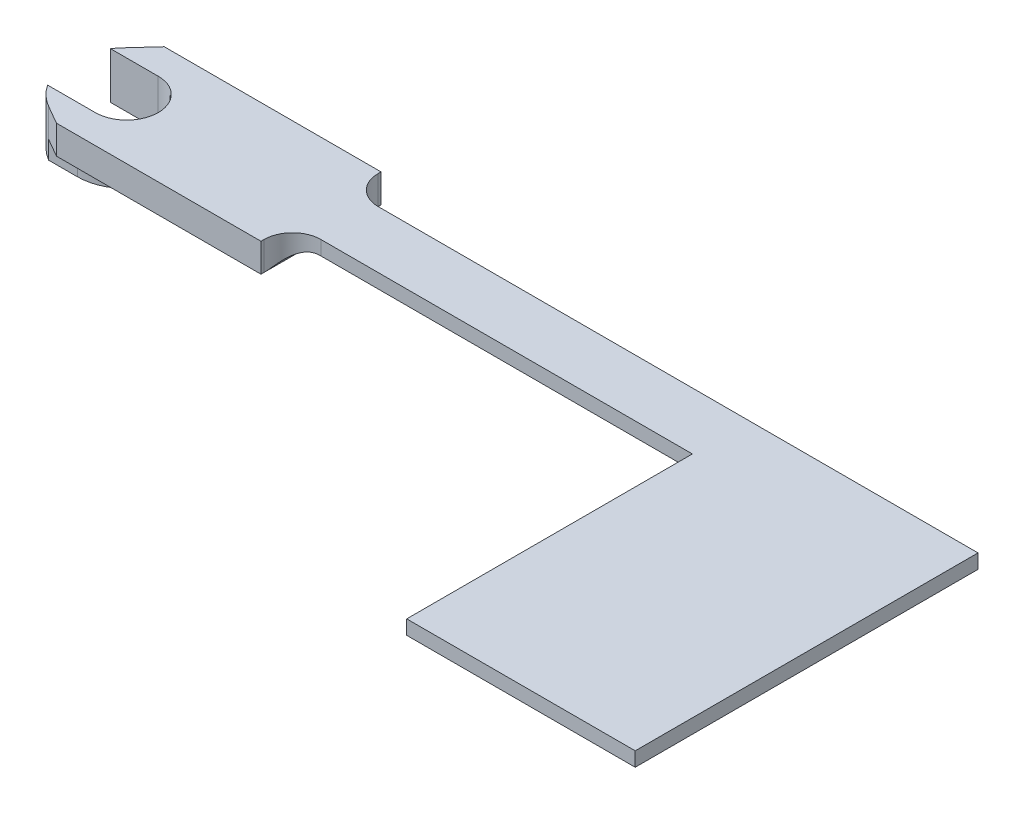
ISO-10303-21;
HEADER;
FILE_DESCRIPTION(('STEP AP214'),'2;1');
FILE_NAME('part.step','',(''),(''),'','','');
FILE_SCHEMA(('AUTOMOTIVE_DESIGN { 1 0 10303 214 1 1 1 1 }'));
ENDSEC;
DATA;
#1=APPLICATION_CONTEXT('core data for automotive mechanical design processes');
#2=APPLICATION_PROTOCOL_DEFINITION('international standard','automotive_design',2000,#1);
#3=PRODUCT_CONTEXT('',#1,'mechanical');
#4=PRODUCT('Part','Part','',(#3));
#5=PRODUCT_RELATED_PRODUCT_CATEGORY('part','',(#4));
#6=PRODUCT_DEFINITION_FORMATION('','',#4);
#7=PRODUCT_DEFINITION_CONTEXT('part definition',#1,'design');
#8=PRODUCT_DEFINITION('design','',#6,#7);
#9=PRODUCT_DEFINITION_SHAPE('','',#8);
#10=(LENGTH_UNIT() NAMED_UNIT(*) SI_UNIT(.MILLI.,.METRE.));
#11=(NAMED_UNIT(*) PLANE_ANGLE_UNIT() SI_UNIT($,.RADIAN.));
#12=(NAMED_UNIT(*) SI_UNIT($,.STERADIAN.) SOLID_ANGLE_UNIT());
#13=UNCERTAINTY_MEASURE_WITH_UNIT(LENGTH_MEASURE(1.E-05),#10,'distance_accuracy_value','');
#14=(GEOMETRIC_REPRESENTATION_CONTEXT(3) GLOBAL_UNCERTAINTY_ASSIGNED_CONTEXT((#13)) GLOBAL_UNIT_ASSIGNED_CONTEXT((#10,
#11,#12)) REPRESENTATION_CONTEXT('',''));
#15=CARTESIAN_POINT('',(0.,0.,0.));
#16=DIRECTION('',(0.,0.,1.));
#17=DIRECTION('',(1.,0.,0.));
#18=AXIS2_PLACEMENT_3D('',#15,#16,#17);
#19=CARTESIAN_POINT('',(21.5921904996352,0.,0.));
#20=DIRECTION('',(1.,0.,0.));
#21=DIRECTION('',(0.,0.,-1.));
#22=AXIS2_PLACEMENT_3D('',#19,#20,#21);
#23=PLANE('',#22);
#24=DIRECTION('',(0.,0.,1.));
#25=VECTOR('',#24,1.);
#26=CARTESIAN_POINT('',(21.5921904996352,3.96875,-6.6750057));
#27=LINE('',#26,#25);
#28=CARTESIAN_POINT('',(21.5921904996352,3.96875,-6.6750057));
#29=VERTEX_POINT('',#28);
#30=CARTESIAN_POINT('',(21.5921904996352,3.96875,-6.35));
#31=VERTEX_POINT('',#30);
#32=EDGE_CURVE('E343',#29,#31,#27,.T.);
#33=ORIENTED_EDGE('',*,*,#32,.T.);
#34=DIRECTION('',(0.,1.,0.));
#35=VECTOR('',#34,1.);
#36=CARTESIAN_POINT('',(21.5921904996352,0.,-6.35));
#37=LINE('',#36,#35);
#38=CARTESIAN_POINT('',(21.5921904996352,0.79375,-6.34999999999999));
#39=VERTEX_POINT('',#38);
#40=EDGE_CURVE('E558',#31,#39,#37,.F.);
#41=ORIENTED_EDGE('',*,*,#40,.T.);
#42=DIRECTION('',(0.,0.,-1.));
#43=VECTOR('',#42,1.);
#44=CARTESIAN_POINT('',(21.5921904996352,0.79375,6.6750057));
#45=LINE('',#44,#43);
#46=CARTESIAN_POINT('',(21.5921904996352,0.79375,-6.6750057));
#47=VERTEX_POINT('',#46);
#48=EDGE_CURVE('E332',#39,#47,#45,.T.);
#49=ORIENTED_EDGE('',*,*,#48,.T.);
#50=DIRECTION('',(0.,1.,0.));
#51=VECTOR('',#50,1.);
#52=CARTESIAN_POINT('',(21.5921904996352,0.79375,-6.6750057));
#53=LINE('',#52,#51);
#54=EDGE_CURVE('E337',#47,#29,#53,.T.);
#55=ORIENTED_EDGE('',*,*,#54,.T.);
#56=EDGE_LOOP('',(#33,#41,#49,#55));
#57=FACE_BOUND('',#56,.T.);
#58=ADVANCED_FACE('F67',(#57),#23,.T.);
#59=CARTESIAN_POINT('',(-3.175,4.7625,5.49926131403118));
#60=DIRECTION('',(0.5,0.,-0.866025403784439));
#61=DIRECTION('',(-0.866025403784438,0.,-0.5));
#62=AXIS2_PLACEMENT_3D('',#59,#60,#61);
#63=PLANE('',#62);
#64=DIRECTION('',(0.,1.,0.));
#65=VECTOR('',#64,1.);
#66=CARTESIAN_POINT('',(-1.13855098678815,-1.20625,6.6750057));
#67=LINE('',#66,#65);
#68=CARTESIAN_POINT('',(-1.13855098678815,0.79375,6.6750057));
#69=VERTEX_POINT('',#68);
#70=CARTESIAN_POINT('',(-1.13855098678815,3.96875,6.6750057));
#71=VERTEX_POINT('',#70);
#72=EDGE_CURVE('E384',#69,#71,#67,.T.);
#73=ORIENTED_EDGE('',*,*,#72,.T.);
#74=DIRECTION('',(0.866025403784439,0.,0.5));
#75=VECTOR('',#74,1.);
#76=CARTESIAN_POINT('',(-3.175,3.96875,5.49926131403118));
#77=LINE('',#76,#75);
#78=CARTESIAN_POINT('',(-3.175,3.96875,5.49926131403119));
#79=VERTEX_POINT('',#78);
#80=EDGE_CURVE('E468',#79,#71,#77,.T.);
#81=ORIENTED_EDGE('',*,*,#80,.F.);
#82=DIRECTION('',(0.,-1.,0.));
#83=VECTOR('',#82,1.);
#84=CARTESIAN_POINT('',(-3.175,4.7625,5.49926131403118));
#85=LINE('',#84,#83);
#86=CARTESIAN_POINT('',(-3.175,-1.20625,5.49926131403119));
#87=VERTEX_POINT('',#86);
#88=EDGE_CURVE('E534',#79,#87,#85,.T.);
#89=ORIENTED_EDGE('',*,*,#88,.T.);
#90=DIRECTION('',(-0.866025403784325,0.,-0.500000000000198));
#91=VECTOR('',#90,1.);
#92=CARTESIAN_POINT('',(-3.175,-1.20625,5.49926131403119));
#93=LINE('',#92,#91);
#94=CARTESIAN_POINT('',(-3.17371068568157,-1.20625,5.5000057));
#95=VERTEX_POINT('',#94);
#96=EDGE_CURVE('E434',#95,#87,#93,.T.);
#97=ORIENTED_EDGE('',*,*,#96,.F.);
#98=DIRECTION('',(0.,1.,0.));
#99=VECTOR('',#98,1.);
#100=CARTESIAN_POINT('',(-3.17371068568157,-1.20625,5.5000057));
#101=LINE('',#100,#99);
#102=CARTESIAN_POINT('',(-3.17371068568157,0.79375,5.5000057));
#103=VERTEX_POINT('',#102);
#104=EDGE_CURVE('E438',#95,#103,#101,.T.);
#105=ORIENTED_EDGE('',*,*,#104,.T.);
#106=DIRECTION('',(0.866025403784439,0.,0.5));
#107=VECTOR('',#106,1.);
#108=CARTESIAN_POINT('',(-3.175,0.79375,5.49926131403118));
#109=LINE('',#108,#107);
#110=EDGE_CURVE('E467',#103,#69,#109,.T.);
#111=ORIENTED_EDGE('',*,*,#110,.T.);
#112=EDGE_LOOP('',(#73,#81,#89,#97,#105,#111));
#113=FACE_BOUND('',#112,.T.);
#114=ADVANCED_FACE('F590',(#113),#63,.F.);
#115=CARTESIAN_POINT('',(28.3147962799527,0.79375,-49.0426657628404));
#116=DIRECTION('',(0.,-1.,0.));
#117=DIRECTION('',(1.,0.,0.));
#118=AXIS2_PLACEMENT_3D('',#115,#116,#117);
#119=PLANE('',#118);
#120=DIRECTION('',(-1.,0.,0.));
#121=VECTOR('',#120,1.);
#122=CARTESIAN_POINT('',(28.3147962799527,0.79375,-6.6750057));
#123=LINE('',#122,#121);
#124=CARTESIAN_POINT('',(-2.50679919036869,0.79375,-6.6750057));
#125=VERTEX_POINT('',#124);
#126=EDGE_CURVE('E397',#47,#125,#123,.T.);
#127=ORIENTED_EDGE('',*,*,#126,.F.);
#128=ORIENTED_EDGE('',*,*,#48,.F.);
#129=CARTESIAN_POINT('',(21.5921904996352,0.79375,6.35));
#130=VERTEX_POINT('',#129);
#131=EDGE_CURVE('E338',#130,#39,#45,.T.);
#132=ORIENTED_EDGE('',*,*,#131,.F.);
#133=CARTESIAN_POINT('',(21.5921904996352,0.79375,6.6750057));
#134=VERTEX_POINT('',#133);
#135=EDGE_CURVE('E333',#134,#130,#45,.T.);
#136=ORIENTED_EDGE('',*,*,#135,.F.);
#137=DIRECTION('',(-1.,0.,0.));
#138=VECTOR('',#137,1.);
#139=CARTESIAN_POINT('',(28.3147962799527,0.79375,6.6750057));
#140=LINE('',#139,#138);
#141=EDGE_CURVE('E387',#134,#69,#140,.T.);
#142=ORIENTED_EDGE('',*,*,#141,.T.);
#143=ORIENTED_EDGE('',*,*,#110,.F.);
#144=DIRECTION('',(-1.,0.,0.));
#145=VECTOR('',#144,1.);
#146=CARTESIAN_POINT('',(-3.17371068568157,0.79375,5.5000057));
#147=LINE('',#146,#145);
#148=CARTESIAN_POINT('',(0.,0.79375,5.5000057));
#149=VERTEX_POINT('',#148);
#150=EDGE_CURVE('E406',#149,#103,#147,.T.);
#151=ORIENTED_EDGE('',*,*,#150,.F.);
#152=CARTESIAN_POINT('',(0.,0.79375,0.));
#153=DIRECTION('',(0.,-1.,0.));
#154=DIRECTION('',(1.,0.,0.));
#155=AXIS2_PLACEMENT_3D('',#152,#153,#154);
#156=CIRCLE('',#155,5.5000057);
#157=CARTESIAN_POINT('',(0.,0.79375,-5.5000057));
#158=VERTEX_POINT('',#157);
#159=EDGE_CURVE('E442',#158,#149,#156,.T.);
#160=ORIENTED_EDGE('',*,*,#159,.F.);
#161=DIRECTION('',(1.,0.,0.));
#162=VECTOR('',#161,1.);
#163=CARTESIAN_POINT('',(-3.57830534978026,0.79375,-5.50000570000001));
#164=LINE('',#163,#162);
#165=CARTESIAN_POINT('',(-3.57830534978026,0.79375,-5.50000570000001));
#166=VERTEX_POINT('',#165);
#167=EDGE_CURVE('E400',#166,#158,#164,.T.);
#168=ORIENTED_EDGE('',*,*,#167,.F.);
#169=DIRECTION('',(-0.673816568047337,0.,0.738898661945539));
#170=VECTOR('',#169,1.);
#171=CARTESIAN_POINT('',(-4.69200650335417,0.79375,-4.27873520710059));
#172=LINE('',#171,#170);
#173=EDGE_CURVE('E472',#125,#166,#172,.T.);
#174=ORIENTED_EDGE('',*,*,#173,.F.);
#175=EDGE_LOOP('',(#127,#128,#132,#136,#142,#143,#151,#160,#168,#174));
#176=FACE_BOUND('',#175,.T.);
#177=ADVANCED_FACE('F599',(#176),#119,.T.);
#178=CARTESIAN_POINT('',(28.3147962799527,3.96875,-49.0426657628404));
#179=DIRECTION('',(0.,-1.,0.));
#180=DIRECTION('',(0.,0.,-1.));
#181=AXIS2_PLACEMENT_3D('',#178,#179,#180);
#182=PLANE('',#181);
#183=DIRECTION('',(1.,0.,0.));
#184=VECTOR('',#183,1.);
#185=CARTESIAN_POINT('',(0.,3.96875,6.6750057));
#186=LINE('',#185,#184);
#187=CARTESIAN_POINT('',(21.5921904996352,3.96875,6.6750057));
#188=VERTEX_POINT('',#187);
#189=EDGE_CURVE('E376',#71,#188,#186,.T.);
#190=ORIENTED_EDGE('',*,*,#189,.T.);
#191=CARTESIAN_POINT('',(21.5921904996352,3.96875,6.35));
#192=VERTEX_POINT('',#191);
#193=EDGE_CURVE('E342',#192,#188,#27,.T.);
#194=ORIENTED_EDGE('',*,*,#193,.F.);
#195=CARTESIAN_POINT('',(24.7671904996352,3.96875,6.35));
#196=DIRECTION('',(0.,-1.,0.));
#197=DIRECTION('',(0.,0.,-1.));
#198=AXIS2_PLACEMENT_3D('',#195,#196,#197);
#199=CIRCLE('',#198,3.175);
#200=CARTESIAN_POINT('',(24.7671904996352,3.96875,3.175));
#201=VERTEX_POINT('',#200);
#202=EDGE_CURVE('E83',#192,#201,#199,.T.);
#203=ORIENTED_EDGE('',*,*,#202,.T.);
#204=DIRECTION('',(1.,0.,0.));
#205=VECTOR('',#204,1.);
#206=CARTESIAN_POINT('',(0.,3.96875,3.175));
#207=LINE('',#206,#205);
#208=CARTESIAN_POINT('',(66.0421904996352,3.96875,3.175));
#209=VERTEX_POINT('',#208);
#210=EDGE_CURVE('E314',#201,#209,#207,.T.);
#211=ORIENTED_EDGE('',*,*,#210,.T.);
#212=DIRECTION('',(0.,0.,1.));
#213=VECTOR('',#212,1.);
#214=CARTESIAN_POINT('',(66.0421904996352,3.96875,0.));
#215=LINE('',#214,#213);
#216=CARTESIAN_POINT('',(66.0421904996352,3.96875,34.925));
#217=VERTEX_POINT('',#216);
#218=EDGE_CURVE('E298',#209,#217,#215,.T.);
#219=ORIENTED_EDGE('',*,*,#218,.T.);
#220=DIRECTION('',(-1.,0.,0.));
#221=VECTOR('',#220,1.);
#222=CARTESIAN_POINT('',(0.,3.96875,34.925));
#223=LINE('',#222,#221);
#224=CARTESIAN_POINT('',(91.4421904996352,3.96875,34.925));
#225=VERTEX_POINT('',#224);
#226=EDGE_CURVE('E294',#225,#217,#223,.T.);
#227=ORIENTED_EDGE('',*,*,#226,.F.);
#228=DIRECTION('',(0.,0.,1.));
#229=VECTOR('',#228,1.);
#230=CARTESIAN_POINT('',(91.4421904996352,3.96875,0.));
#231=LINE('',#230,#229);
#232=CARTESIAN_POINT('',(91.4421904996352,3.96875,-3.175));
#233=VERTEX_POINT('',#232);
#234=EDGE_CURVE('E309',#233,#225,#231,.T.);
#235=ORIENTED_EDGE('',*,*,#234,.F.);
#236=DIRECTION('',(1.,0.,0.));
#237=VECTOR('',#236,1.);
#238=CARTESIAN_POINT('',(0.,3.96875,-3.175));
#239=LINE('',#238,#237);
#240=CARTESIAN_POINT('',(24.7671904996352,3.96875,-3.175));
#241=VERTEX_POINT('',#240);
#242=EDGE_CURVE('E282',#241,#233,#239,.T.);
#243=ORIENTED_EDGE('',*,*,#242,.F.);
#244=CARTESIAN_POINT('',(24.7671904996352,3.96875,-6.35));
#245=DIRECTION('',(0.,-1.,0.));
#246=DIRECTION('',(0.,0.,-1.));
#247=AXIS2_PLACEMENT_3D('',#244,#245,#246);
#248=CIRCLE('',#247,3.175);
#249=EDGE_CURVE('E566',#241,#31,#248,.T.);
#250=ORIENTED_EDGE('',*,*,#249,.T.);
#251=ORIENTED_EDGE('',*,*,#32,.F.);
#252=DIRECTION('',(1.,0.,0.));
#253=VECTOR('',#252,1.);
#254=CARTESIAN_POINT('',(0.,3.96875,-6.6750057));
#255=LINE('',#254,#253);
#256=CARTESIAN_POINT('',(-2.50679919036869,3.96875,-6.6750057));
#257=VERTEX_POINT('',#256);
#258=EDGE_CURVE('E380',#257,#29,#255,.T.);
#259=ORIENTED_EDGE('',*,*,#258,.F.);
#260=DIRECTION('',(-0.673816568047337,0.,0.738898661945539));
#261=VECTOR('',#260,1.);
#262=CARTESIAN_POINT('',(-4.69200650335417,3.96875,-4.27873520710059));
#263=LINE('',#262,#261);
#264=CARTESIAN_POINT('',(-4.69200650335417,3.96875,-4.27873520710059));
#265=VERTEX_POINT('',#264);
#266=EDGE_CURVE('E537',#257,#265,#263,.T.);
#267=ORIENTED_EDGE('',*,*,#266,.T.);
#268=CARTESIAN_POINT('',(0.,3.96875,0.));
#269=DIRECTION('',(0.,-1.,0.));
#270=DIRECTION('',(0.,0.,-1.));
#271=AXIS2_PLACEMENT_3D('',#268,#269,#270);
#272=CIRCLE('',#271,6.35);
#273=CARTESIAN_POINT('',(-5.29834503406182,3.96875,-3.5000057));
#274=VERTEX_POINT('',#273);
#275=EDGE_CURVE('E478',#274,#265,#272,.T.);
#276=ORIENTED_EDGE('',*,*,#275,.F.);
#277=DIRECTION('',(1.,0.,0.));
#278=VECTOR('',#277,1.);
#279=CARTESIAN_POINT('',(28.3147962799527,3.96875,-3.5000057));
#280=LINE('',#279,#278);
#281=CARTESIAN_POINT('',(0.,3.96875,-3.5000057));
#282=VERTEX_POINT('',#281);
#283=EDGE_CURVE('E540',#274,#282,#280,.T.);
#284=ORIENTED_EDGE('',*,*,#283,.T.);
#285=CARTESIAN_POINT('',(0.,3.96875,0.));
#286=DIRECTION('',(0.,-1.,0.));
#287=DIRECTION('',(0.,0.,-1.));
#288=AXIS2_PLACEMENT_3D('',#285,#286,#287);
#289=CIRCLE('',#288,3.5000057);
#290=CARTESIAN_POINT('',(0.,3.96875,3.5000057));
#291=VERTEX_POINT('',#290);
#292=EDGE_CURVE('E544',#282,#291,#289,.T.);
#293=ORIENTED_EDGE('',*,*,#292,.T.);
#294=DIRECTION('',(-1.,0.,0.));
#295=VECTOR('',#294,1.);
#296=CARTESIAN_POINT('',(28.3147962799528,3.96875,3.5000057));
#297=LINE('',#296,#295);
#298=CARTESIAN_POINT('',(-5.29834503406182,3.96875,3.5000057));
#299=VERTEX_POINT('',#298);
#300=EDGE_CURVE('E548',#291,#299,#297,.T.);
#301=ORIENTED_EDGE('',*,*,#300,.T.);
#302=EDGE_CURVE('E479',#79,#299,#272,.T.);
#303=ORIENTED_EDGE('',*,*,#302,.F.);
#304=ORIENTED_EDGE('',*,*,#80,.T.);
#305=EDGE_LOOP('',(#190,#194,#203,#211,#219,#227,#235,#243,#250,#251,#259,#267,#276,#284,#293,
#301,#303,#304));
#306=FACE_BOUND('',#305,.T.);
#307=ADVANCED_FACE('F631',(#306),#182,.F.);
#308=CARTESIAN_POINT('',(0.,4.7625,0.));
#309=DIRECTION('',(0.,-1.,0.));
#310=DIRECTION('',(0.,0.,-1.));
#311=AXIS2_PLACEMENT_3D('',#308,#309,#310);
#312=CYLINDRICAL_SURFACE('',#311,6.35);
#313=ORIENTED_EDGE('',*,*,#302,.T.);
#314=DIRECTION('',(0.,-1.,0.));
#315=VECTOR('',#314,1.);
#316=CARTESIAN_POINT('',(-5.29834503406182,16.8464882443737,3.5000057));
#317=LINE('',#316,#315);
#318=CARTESIAN_POINT('',(-5.29834503406182,-1.20625,3.5000057));
#319=VERTEX_POINT('',#318);
#320=EDGE_CURVE('E519',#299,#319,#317,.T.);
#321=ORIENTED_EDGE('',*,*,#320,.T.);
#322=CARTESIAN_POINT('',(0.,-1.20625,0.));
#323=DIRECTION('',(0.,-1.,0.));
#324=DIRECTION('',(1.,0.,0.));
#325=AXIS2_PLACEMENT_3D('',#322,#323,#324);
#326=CIRCLE('',#325,6.35);
#327=EDGE_CURVE('E401',#87,#319,#326,.T.);
#328=ORIENTED_EDGE('',*,*,#327,.F.);
#329=ORIENTED_EDGE('',*,*,#88,.F.);
#330=EDGE_LOOP('',(#313,#321,#328,#329));
#331=FACE_BOUND('',#330,.T.);
#332=ADVANCED_FACE('F682',(#331),#312,.T.);
#333=CARTESIAN_POINT('',(0.,16.8464882443737,0.));
#334=DIRECTION('',(0.,-1.,0.));
#335=DIRECTION('',(0.,0.,-1.));
#336=AXIS2_PLACEMENT_3D('',#333,#334,#335);
#337=CYLINDRICAL_SURFACE('',#336,3.5000057);
#338=DIRECTION('',(0.,-1.,0.));
#339=VECTOR('',#338,1.);
#340=CARTESIAN_POINT('',(0.,16.8464882443737,3.5000057));
#341=LINE('',#340,#339);
#342=CARTESIAN_POINT('',(0.,-1.20625,3.5000057));
#343=VERTEX_POINT('',#342);
#344=EDGE_CURVE('E523',#291,#343,#341,.T.);
#345=ORIENTED_EDGE('',*,*,#344,.F.);
#346=ORIENTED_EDGE('',*,*,#292,.F.);
#347=DIRECTION('',(0.,-1.,0.));
#348=VECTOR('',#347,1.);
#349=CARTESIAN_POINT('',(0.,16.8464882443737,-3.5000057));
#350=LINE('',#349,#348);
#351=CARTESIAN_POINT('',(0.,-1.20625,-3.5000057));
#352=VERTEX_POINT('',#351);
#353=EDGE_CURVE('E520',#282,#352,#350,.T.);
#354=ORIENTED_EDGE('',*,*,#353,.T.);
#355=CARTESIAN_POINT('',(0.,-1.20625,0.));
#356=DIRECTION('',(0.,1.,0.));
#357=DIRECTION('',(1.,0.,0.));
#358=AXIS2_PLACEMENT_3D('',#355,#356,#357);
#359=CIRCLE('',#358,3.5000057);
#360=EDGE_CURVE('E410',#343,#352,#359,.T.);
#361=ORIENTED_EDGE('',*,*,#360,.F.);
#362=EDGE_LOOP('',(#345,#346,#354,#361));
#363=FACE_BOUND('',#362,.T.);
#364=CARTESIAN_POINT('',(0.,3.37125,0.));
#365=DIRECTION('',(0.,-1.,0.));
#366=DIRECTION('',(0.,0.,-1.));
#367=AXIS2_PLACEMENT_3D('',#364,#365,#366);
#368=CIRCLE('',#367,3.5000057);
#369=CARTESIAN_POINT('',(1.80278670397595,3.37125,-3.));
#370=VERTEX_POINT('',#369);
#371=CARTESIAN_POINT('',(1.80278670397595,3.37125,3.));
#372=VERTEX_POINT('',#371);
#373=EDGE_CURVE('E464',#370,#372,#368,.T.);
#374=ORIENTED_EDGE('',*,*,#373,.T.);
#375=DIRECTION('',(0.,1.,0.));
#376=VECTOR('',#375,1.);
#377=CARTESIAN_POINT('',(1.80278670397595,-17.0880074906351,3.));
#378=LINE('',#377,#376);
#379=CARTESIAN_POINT('',(1.80278670397595,1.39125,3.));
#380=VERTEX_POINT('',#379);
#381=EDGE_CURVE('E505',#380,#372,#378,.T.);
#382=ORIENTED_EDGE('',*,*,#381,.F.);
#383=CARTESIAN_POINT('',(0.,1.39125,0.));
#384=DIRECTION('',(0.,1.,0.));
#385=DIRECTION('',(0.,0.,1.));
#386=AXIS2_PLACEMENT_3D('',#383,#384,#385);
#387=CIRCLE('',#386,3.5000057);
#388=CARTESIAN_POINT('',(1.80278670397595,1.39125,-3.));
#389=VERTEX_POINT('',#388);
#390=EDGE_CURVE('E489',#389,#380,#387,.F.);
#391=ORIENTED_EDGE('',*,*,#390,.F.);
#392=DIRECTION('',(0.,1.,0.));
#393=VECTOR('',#392,1.);
#394=CARTESIAN_POINT('',(1.80278670397595,-17.0880074906351,-3.));
#395=LINE('',#394,#393);
#396=EDGE_CURVE('E501',#389,#370,#395,.T.);
#397=ORIENTED_EDGE('',*,*,#396,.T.);
#398=EDGE_LOOP('',(#374,#382,#391,#397));
#399=FACE_BOUND('',#398,.T.);
#400=ADVANCED_FACE('F675',(#363,#399),#337,.F.);
#401=DIRECTION('',(0.,-1.,0.));
#402=VECTOR('',#401,1.);
#403=CARTESIAN_POINT('',(-5.29834503406182,16.8464882443737,-3.5000057));
#404=LINE('',#403,#402);
#405=CARTESIAN_POINT('',(-5.29834503406182,-1.20625,-3.5000057));
#406=VERTEX_POINT('',#405);
#407=EDGE_CURVE('E524',#274,#406,#404,.T.);
#408=ORIENTED_EDGE('',*,*,#407,.F.);
#409=ORIENTED_EDGE('',*,*,#275,.T.);
#410=DIRECTION('',(0.,-1.,0.));
#411=VECTOR('',#410,1.);
#412=CARTESIAN_POINT('',(-4.69200650335417,4.7625,-4.27873520710059));
#413=LINE('',#412,#411);
#414=CARTESIAN_POINT('',(-4.69200650335417,-1.20625,-4.27873520710059));
#415=VERTEX_POINT('',#414);
#416=EDGE_CURVE('E531',#265,#415,#413,.T.);
#417=ORIENTED_EDGE('',*,*,#416,.T.);
#418=CARTESIAN_POINT('',(0.,-1.20625,0.));
#419=DIRECTION('',(0.,-1.,0.));
#420=DIRECTION('',(1.,0.,0.));
#421=AXIS2_PLACEMENT_3D('',#418,#419,#420);
#422=CIRCLE('',#421,6.35);
#423=EDGE_CURVE('E418',#406,#415,#422,.T.);
#424=ORIENTED_EDGE('',*,*,#423,.F.);
#425=EDGE_LOOP('',(#408,#409,#417,#424));
#426=FACE_BOUND('',#425,.T.);
#427=ADVANCED_FACE('F663',(#426),#312,.T.);
#428=CARTESIAN_POINT('',(-4.69200650335417,4.7625,-4.27873520710059));
#429=DIRECTION('',(-0.738898661945539,0.,-0.673816568047337));
#430=DIRECTION('',(-0.673816568047337,0.,0.738898661945539));
#431=AXIS2_PLACEMENT_3D('',#428,#429,#430);
#432=PLANE('',#431);
#433=DIRECTION('',(0.,1.,0.));
#434=VECTOR('',#433,1.);
#435=CARTESIAN_POINT('',(-2.50679919036869,-1.20625,-6.6750057));
#436=LINE('',#435,#434);
#437=EDGE_CURVE('E383',#125,#257,#436,.T.);
#438=ORIENTED_EDGE('',*,*,#437,.F.);
#439=ORIENTED_EDGE('',*,*,#173,.T.);
#440=DIRECTION('',(0.,1.,0.));
#441=VECTOR('',#440,1.);
#442=CARTESIAN_POINT('',(-3.57830534978026,-1.20625,-5.50000570000001));
#443=LINE('',#442,#441);
#444=CARTESIAN_POINT('',(-3.57830534978026,-1.20625,-5.50000570000001));
#445=VERTEX_POINT('',#444);
#446=EDGE_CURVE('E460',#445,#166,#443,.T.);
#447=ORIENTED_EDGE('',*,*,#446,.F.);
#448=DIRECTION('',(0.67381656804734,0.,-0.738898661945537));
#449=VECTOR('',#448,1.);
#450=CARTESIAN_POINT('',(-3.57830534978026,-1.20625,-5.50000570000001));
#451=LINE('',#450,#449);
#452=EDGE_CURVE('E422',#415,#445,#451,.T.);
#453=ORIENTED_EDGE('',*,*,#452,.F.);
#454=ORIENTED_EDGE('',*,*,#416,.F.);
#455=ORIENTED_EDGE('',*,*,#266,.F.);
#456=EDGE_LOOP('',(#438,#439,#447,#453,#454,#455));
#457=FACE_BOUND('',#456,.T.);
#458=ADVANCED_FACE('F658',(#457),#432,.T.);
#459=CARTESIAN_POINT('',(0.,16.8464882443737,3.5000057));
#460=DIRECTION('',(0.,0.,1.));
#461=DIRECTION('',(1.,0.,0.));
#462=AXIS2_PLACEMENT_3D('',#459,#460,#461);
#463=PLANE('',#462);
#464=ORIENTED_EDGE('',*,*,#344,.T.);
#465=DIRECTION('',(1.,0.,0.));
#466=VECTOR('',#465,1.);
#467=CARTESIAN_POINT('',(-5.29834503406182,-1.20625,3.5000057));
#468=LINE('',#467,#466);
#469=EDGE_CURVE('E405',#319,#343,#468,.T.);
#470=ORIENTED_EDGE('',*,*,#469,.F.);
#471=ORIENTED_EDGE('',*,*,#320,.F.);
#472=ORIENTED_EDGE('',*,*,#300,.F.);
#473=EDGE_LOOP('',(#464,#470,#471,#472));
#474=FACE_BOUND('',#473,.T.);
#475=ADVANCED_FACE('F679',(#474),#463,.F.);
#476=CARTESIAN_POINT('',(0.,16.8464882443737,-3.5000057));
#477=DIRECTION('',(0.,0.,1.));
#478=DIRECTION('',(1.,0.,0.));
#479=AXIS2_PLACEMENT_3D('',#476,#477,#478);
#480=PLANE('',#479);
#481=ORIENTED_EDGE('',*,*,#407,.T.);
#482=DIRECTION('',(-1.,0.,0.));
#483=VECTOR('',#482,1.);
#484=CARTESIAN_POINT('',(-5.29834503406182,-1.20625,-3.5000057));
#485=LINE('',#484,#483);
#486=EDGE_CURVE('E414',#352,#406,#485,.T.);
#487=ORIENTED_EDGE('',*,*,#486,.F.);
#488=ORIENTED_EDGE('',*,*,#353,.F.);
#489=ORIENTED_EDGE('',*,*,#283,.F.);
#490=EDGE_LOOP('',(#481,#487,#488,#489));
#491=FACE_BOUND('',#490,.T.);
#492=ADVANCED_FACE('F669',(#491),#480,.T.);
#493=CARTESIAN_POINT('',(0.,3.37125,0.));
#494=DIRECTION('',(0.,1.,0.));
#495=DIRECTION('',(0.,0.,1.));
#496=AXIS2_PLACEMENT_3D('',#493,#494,#495);
#497=PLANE('',#496);
#498=DIRECTION('',(-0.998052578482889,0.,0.0623782861551805));
#499=VECTOR('',#498,1.);
#500=CARTESIAN_POINT('',(17.802786703976,3.37125,2.));
#501=LINE('',#500,#499);
#502=CARTESIAN_POINT('',(17.5479858090224,3.37125,2.0159250559346));
#503=VERTEX_POINT('',#502);
#504=EDGE_CURVE('E497',#503,#372,#501,.T.);
#505=ORIENTED_EDGE('',*,*,#504,.T.);
#506=ORIENTED_EDGE('',*,*,#373,.F.);
#507=DIRECTION('',(0.998052578482889,0.,0.0623782861551805));
#508=VECTOR('',#507,1.);
#509=CARTESIAN_POINT('',(1.80278670397595,3.37125,-3.));
#510=LINE('',#509,#508);
#511=CARTESIAN_POINT('',(17.5479858090224,3.37125,-2.0159250559346));
#512=VERTEX_POINT('',#511);
#513=EDGE_CURVE('E483',#370,#512,#510,.T.);
#514=ORIENTED_EDGE('',*,*,#513,.T.);
#515=DIRECTION('',(1.,0.,0.));
#516=VECTOR('',#515,1.);
#517=CARTESIAN_POINT('',(-5.30034503406181,3.37125,-2.0159250559346));
#518=LINE('',#517,#516);
#519=CARTESIAN_POINT('',(18.4171904996352,3.37125,-2.0159250559346));
#520=VERTEX_POINT('',#519);
#521=EDGE_CURVE('E363',#512,#520,#518,.T.);
#522=ORIENTED_EDGE('',*,*,#521,.T.);
#523=DIRECTION('',(0.,0.,1.));
#524=VECTOR('',#523,1.);
#525=CARTESIAN_POINT('',(18.4171904996352,3.37125,2.0159250559346));
#526=LINE('',#525,#524);
#527=CARTESIAN_POINT('',(18.4171904996352,3.37125,2.0159250559346));
#528=VERTEX_POINT('',#527);
#529=EDGE_CURVE('E348',#520,#528,#526,.T.);
#530=ORIENTED_EDGE('',*,*,#529,.T.);
#531=DIRECTION('',(1.,0.,0.));
#532=VECTOR('',#531,1.);
#533=CARTESIAN_POINT('',(-5.30034503406181,3.37125,2.0159250559346));
#534=LINE('',#533,#532);
#535=EDGE_CURVE('E367',#503,#528,#534,.T.);
#536=ORIENTED_EDGE('',*,*,#535,.F.);
#537=EDGE_LOOP('',(#505,#506,#514,#522,#530,#536));
#538=FACE_BOUND('',#537,.T.);
#539=ADVANCED_FACE('F720',(#538),#497,.F.);
#540=CARTESIAN_POINT('',(17.802786703976,-17.0880074906351,2.));
#541=DIRECTION('',(-0.0623782861551805,0.,-0.998052578482889));
#542=DIRECTION('',(-0.998052578482889,0.,0.0623782861551805));
#543=AXIS2_PLACEMENT_3D('',#540,#541,#542);
#544=PLANE('',#543);
#545=DIRECTION('',(0.998052578482889,0.,-0.0623782861551805));
#546=VECTOR('',#545,1.);
#547=CARTESIAN_POINT('',(17.802786703976,1.39125,2.));
#548=LINE('',#547,#546);
#549=CARTESIAN_POINT('',(17.5479858090224,1.39125,2.0159250559346));
#550=VERTEX_POINT('',#549);
#551=EDGE_CURVE('E484',#380,#550,#548,.T.);
#552=ORIENTED_EDGE('',*,*,#551,.F.);
#553=ORIENTED_EDGE('',*,*,#381,.T.);
#554=ORIENTED_EDGE('',*,*,#504,.F.);
#555=DIRECTION('',(0.,-1.,0.));
#556=VECTOR('',#555,1.);
#557=CARTESIAN_POINT('',(17.5479858090224,4.7625,2.0159250559346));
#558=LINE('',#557,#556);
#559=EDGE_CURVE('E515',#550,#503,#558,.F.);
#560=ORIENTED_EDGE('',*,*,#559,.F.);
#561=EDGE_LOOP('',(#552,#553,#554,#560));
#562=FACE_BOUND('',#561,.T.);
#563=ADVANCED_FACE('F717',(#562),#544,.T.);
#564=CARTESIAN_POINT('',(1.80278670397595,-17.0880074906351,-3.));
#565=DIRECTION('',(-0.0623782861551805,0.,0.998052578482889));
#566=DIRECTION('',(0.998052578482889,0.,0.0623782861551805));
#567=AXIS2_PLACEMENT_3D('',#564,#565,#566);
#568=PLANE('',#567);
#569=ORIENTED_EDGE('',*,*,#513,.F.);
#570=ORIENTED_EDGE('',*,*,#396,.F.);
#571=DIRECTION('',(-0.998052578482889,0.,-0.0623782861551805));
#572=VECTOR('',#571,1.);
#573=CARTESIAN_POINT('',(1.80278670397595,1.39125,-3.));
#574=LINE('',#573,#572);
#575=CARTESIAN_POINT('',(17.5479858090223,1.39125,-2.0159250559346));
#576=VERTEX_POINT('',#575);
#577=EDGE_CURVE('E488',#576,#389,#574,.T.);
#578=ORIENTED_EDGE('',*,*,#577,.F.);
#579=DIRECTION('',(0.,-1.,0.));
#580=VECTOR('',#579,1.);
#581=CARTESIAN_POINT('',(17.5479858090224,4.7625,-2.0159250559346));
#582=LINE('',#581,#580);
#583=EDGE_CURVE('E493',#512,#576,#582,.T.);
#584=ORIENTED_EDGE('',*,*,#583,.F.);
#585=EDGE_LOOP('',(#569,#570,#578,#584));
#586=FACE_BOUND('',#585,.T.);
#587=ADVANCED_FACE('F709',(#586),#568,.T.);
#588=CARTESIAN_POINT('',(0.,1.39125,0.));
#589=DIRECTION('',(0.,1.,0.));
#590=DIRECTION('',(0.,0.,1.));
#591=AXIS2_PLACEMENT_3D('',#588,#589,#590);
#592=PLANE('',#591);
#593=ORIENTED_EDGE('',*,*,#577,.T.);
#594=ORIENTED_EDGE('',*,*,#390,.T.);
#595=ORIENTED_EDGE('',*,*,#551,.T.);
#596=DIRECTION('',(1.,0.,0.));
#597=VECTOR('',#596,1.);
#598=CARTESIAN_POINT('',(-5.30034503406181,1.39125,2.0159250559346));
#599=LINE('',#598,#597);
#600=CARTESIAN_POINT('',(18.4171904996352,1.39125,2.0159250559346));
#601=VERTEX_POINT('',#600);
#602=EDGE_CURVE('E371',#550,#601,#599,.T.);
#603=ORIENTED_EDGE('',*,*,#602,.T.);
#604=DIRECTION('',(0.,0.,-1.));
#605=VECTOR('',#604,1.);
#606=CARTESIAN_POINT('',(18.4171904996352,1.39125,-2.0159250559346));
#607=LINE('',#606,#605);
#608=CARTESIAN_POINT('',(18.4171904996352,1.39125,-2.0159250559346));
#609=VERTEX_POINT('',#608);
#610=EDGE_CURVE('E347',#601,#609,#607,.T.);
#611=ORIENTED_EDGE('',*,*,#610,.T.);
#612=DIRECTION('',(1.,0.,0.));
#613=VECTOR('',#612,1.);
#614=CARTESIAN_POINT('',(-5.30034503406181,1.39125,-2.0159250559346));
#615=LINE('',#614,#613);
#616=EDGE_CURVE('E372',#576,#609,#615,.T.);
#617=ORIENTED_EDGE('',*,*,#616,.F.);
#618=EDGE_LOOP('',(#593,#594,#595,#603,#611,#617));
#619=FACE_BOUND('',#618,.T.);
#620=ADVANCED_FACE('F701',(#619),#592,.T.);
#621=CARTESIAN_POINT('',(-3.57830534978026,-1.20625,-5.50000570000001));
#622=DIRECTION('',(0.,0.,1.));
#623=DIRECTION('',(1.,0.,0.));
#624=AXIS2_PLACEMENT_3D('',#621,#622,#623);
#625=PLANE('',#624);
#626=ORIENTED_EDGE('',*,*,#167,.T.);
#627=DIRECTION('',(0.,1.,0.));
#628=VECTOR('',#627,1.);
#629=CARTESIAN_POINT('',(0.,-1.20625,-5.5000057));
#630=LINE('',#629,#628);
#631=CARTESIAN_POINT('',(0.,-1.20625,-5.5000057));
#632=VERTEX_POINT('',#631);
#633=EDGE_CURVE('E456',#632,#158,#630,.T.);
#634=ORIENTED_EDGE('',*,*,#633,.F.);
#635=DIRECTION('',(1.,0.,0.));
#636=VECTOR('',#635,1.);
#637=CARTESIAN_POINT('',(-3.57830534978026,-1.20625,-5.50000570000001));
#638=LINE('',#637,#636);
#639=EDGE_CURVE('E425',#445,#632,#638,.T.);
#640=ORIENTED_EDGE('',*,*,#639,.F.);
#641=ORIENTED_EDGE('',*,*,#446,.T.);
#642=EDGE_LOOP('',(#626,#634,#640,#641));
#643=FACE_BOUND('',#642,.T.);
#644=ADVANCED_FACE('F699',(#643),#625,.F.);
#645=CARTESIAN_POINT('',(0.,-1.20625,0.));
#646=DIRECTION('',(0.,1.,0.));
#647=DIRECTION('',(-1.,0.,0.));
#648=AXIS2_PLACEMENT_3D('',#645,#646,#647);
#649=CYLINDRICAL_SURFACE('',#648,5.5000057);
#650=ORIENTED_EDGE('',*,*,#159,.T.);
#651=DIRECTION('',(0.,1.,0.));
#652=VECTOR('',#651,1.);
#653=CARTESIAN_POINT('',(0.,-1.20625,5.5000057));
#654=LINE('',#653,#652);
#655=CARTESIAN_POINT('',(0.,-1.20625,5.5000057));
#656=VERTEX_POINT('',#655);
#657=EDGE_CURVE('E452',#656,#149,#654,.T.);
#658=ORIENTED_EDGE('',*,*,#657,.F.);
#659=CARTESIAN_POINT('',(0.,-1.20625,0.));
#660=DIRECTION('',(0.,-1.,0.));
#661=DIRECTION('',(1.,0.,0.));
#662=AXIS2_PLACEMENT_3D('',#659,#660,#661);
#663=CIRCLE('',#662,5.5000057);
#664=EDGE_CURVE('E428',#632,#656,#663,.T.);
#665=ORIENTED_EDGE('',*,*,#664,.F.);
#666=ORIENTED_EDGE('',*,*,#633,.T.);
#667=EDGE_LOOP('',(#650,#658,#665,#666));
#668=FACE_BOUND('',#667,.T.);
#669=ADVANCED_FACE('F697',(#668),#649,.T.);
#670=CARTESIAN_POINT('',(-3.17371068568157,-1.20625,5.5000057));
#671=DIRECTION('',(0.,0.,-1.));
#672=DIRECTION('',(-1.,0.,0.));
#673=AXIS2_PLACEMENT_3D('',#670,#671,#672);
#674=PLANE('',#673);
#675=ORIENTED_EDGE('',*,*,#150,.T.);
#676=ORIENTED_EDGE('',*,*,#104,.F.);
#677=DIRECTION('',(-1.,0.,0.));
#678=VECTOR('',#677,1.);
#679=CARTESIAN_POINT('',(-3.17371068568157,-1.20625,5.5000057));
#680=LINE('',#679,#678);
#681=EDGE_CURVE('E431',#656,#95,#680,.T.);
#682=ORIENTED_EDGE('',*,*,#681,.F.);
#683=ORIENTED_EDGE('',*,*,#657,.T.);
#684=EDGE_LOOP('',(#675,#676,#682,#683));
#685=FACE_BOUND('',#684,.T.);
#686=ADVANCED_FACE('F690',(#685),#674,.F.);
#687=CARTESIAN_POINT('',(0.,-1.20625,0.));
#688=DIRECTION('',(0.,-1.,0.));
#689=DIRECTION('',(1.,0.,0.));
#690=AXIS2_PLACEMENT_3D('',#687,#688,#689);
#691=PLANE('',#690);
#692=ORIENTED_EDGE('',*,*,#327,.T.);
#693=ORIENTED_EDGE('',*,*,#469,.T.);
#694=ORIENTED_EDGE('',*,*,#360,.T.);
#695=ORIENTED_EDGE('',*,*,#486,.T.);
#696=ORIENTED_EDGE('',*,*,#423,.T.);
#697=ORIENTED_EDGE('',*,*,#452,.T.);
#698=ORIENTED_EDGE('',*,*,#639,.T.);
#699=ORIENTED_EDGE('',*,*,#664,.T.);
#700=ORIENTED_EDGE('',*,*,#681,.T.);
#701=ORIENTED_EDGE('',*,*,#96,.T.);
#702=EDGE_LOOP('',(#692,#693,#694,#695,#696,#697,#698,#699,#700,#701));
#703=FACE_BOUND('',#702,.T.);
#704=ADVANCED_FACE('F665',(#703),#691,.T.);
#705=CARTESIAN_POINT('',(0.,-1.20625,6.6750057));
#706=DIRECTION('',(0.,0.,1.));
#707=DIRECTION('',(1.,0.,0.));
#708=AXIS2_PLACEMENT_3D('',#705,#706,#707);
#709=PLANE('',#708);
#710=ORIENTED_EDGE('',*,*,#141,.F.);
#711=DIRECTION('',(0.,-1.,0.));
#712=VECTOR('',#711,1.);
#713=CARTESIAN_POINT('',(21.5921904996352,3.96875,6.6750057));
#714=LINE('',#713,#712);
#715=EDGE_CURVE('E322',#188,#134,#714,.T.);
#716=ORIENTED_EDGE('',*,*,#715,.F.);
#717=ORIENTED_EDGE('',*,*,#189,.F.);
#718=ORIENTED_EDGE('',*,*,#72,.F.);
#719=EDGE_LOOP('',(#710,#716,#717,#718));
#720=FACE_BOUND('',#719,.T.);
#721=ADVANCED_FACE('F687',(#720),#709,.T.);
#722=CARTESIAN_POINT('',(0.,-1.20625,-6.6750057));
#723=DIRECTION('',(0.,0.,1.));
#724=DIRECTION('',(1.,0.,0.));
#725=AXIS2_PLACEMENT_3D('',#722,#723,#724);
#726=PLANE('',#725);
#727=ORIENTED_EDGE('',*,*,#126,.T.);
#728=ORIENTED_EDGE('',*,*,#437,.T.);
#729=ORIENTED_EDGE('',*,*,#258,.T.);
#730=ORIENTED_EDGE('',*,*,#54,.F.);
#731=EDGE_LOOP('',(#727,#728,#729,#730));
#732=FACE_BOUND('',#731,.T.);
#733=ADVANCED_FACE('F651',(#732),#726,.F.);
#734=CARTESIAN_POINT('',(-5.30034503406181,1.39125,2.0159250559346));
#735=DIRECTION('',(0.,0.,1.));
#736=DIRECTION('',(0.,-1.,0.));
#737=AXIS2_PLACEMENT_3D('',#734,#735,#736);
#738=PLANE('',#737);
#739=ORIENTED_EDGE('',*,*,#602,.F.);
#740=ORIENTED_EDGE('',*,*,#559,.T.);
#741=ORIENTED_EDGE('',*,*,#535,.T.);
#742=DIRECTION('',(0.,-1.,0.));
#743=VECTOR('',#742,1.);
#744=CARTESIAN_POINT('',(18.4171904996352,1.39125,2.0159250559346));
#745=LINE('',#744,#743);
#746=EDGE_CURVE('E353',#528,#601,#745,.T.);
#747=ORIENTED_EDGE('',*,*,#746,.T.);
#748=EDGE_LOOP('',(#739,#740,#741,#747));
#749=FACE_BOUND('',#748,.T.);
#750=ADVANCED_FACE('F614',(#749),#738,.F.);
#751=CARTESIAN_POINT('',(-5.30034503406181,3.37125,-2.0159250559346));
#752=DIRECTION('',(0.,0.,-1.));
#753=DIRECTION('',(0.,1.,0.));
#754=AXIS2_PLACEMENT_3D('',#751,#752,#753);
#755=PLANE('',#754);
#756=ORIENTED_EDGE('',*,*,#521,.F.);
#757=ORIENTED_EDGE('',*,*,#583,.T.);
#758=ORIENTED_EDGE('',*,*,#616,.T.);
#759=DIRECTION('',(0.,1.,0.));
#760=VECTOR('',#759,1.);
#761=CARTESIAN_POINT('',(18.4171904996352,3.37125,-2.0159250559346));
#762=LINE('',#761,#760);
#763=EDGE_CURVE('E352',#609,#520,#762,.T.);
#764=ORIENTED_EDGE('',*,*,#763,.T.);
#765=EDGE_LOOP('',(#756,#757,#758,#764));
#766=FACE_BOUND('',#765,.T.);
#767=ADVANCED_FACE('F612',(#766),#755,.F.);
#768=CARTESIAN_POINT('',(18.4171904996352,0.,0.));
#769=DIRECTION('',(1.,0.,0.));
#770=DIRECTION('',(0.,0.,-1.));
#771=AXIS2_PLACEMENT_3D('',#768,#769,#770);
#772=PLANE('',#771);
#773=ORIENTED_EDGE('',*,*,#763,.F.);
#774=ORIENTED_EDGE('',*,*,#610,.F.);
#775=ORIENTED_EDGE('',*,*,#746,.F.);
#776=ORIENTED_EDGE('',*,*,#529,.F.);
#777=EDGE_LOOP('',(#773,#774,#775,#776));
#778=FACE_BOUND('',#777,.T.);
#779=ADVANCED_FACE('F605',(#778),#772,.F.);
#780=ORIENTED_EDGE('',*,*,#135,.T.);
#781=DIRECTION('',(0.,1.,0.));
#782=VECTOR('',#781,1.);
#783=CARTESIAN_POINT('',(21.5921904996352,3.96875,6.35));
#784=LINE('',#783,#782);
#785=EDGE_CURVE('E555',#130,#192,#784,.T.);
#786=ORIENTED_EDGE('',*,*,#785,.T.);
#787=ORIENTED_EDGE('',*,*,#193,.T.);
#788=ORIENTED_EDGE('',*,*,#715,.T.);
#789=EDGE_LOOP('',(#780,#786,#787,#788));
#790=FACE_BOUND('',#789,.T.);
#791=ADVANCED_FACE('F593',(#790),#23,.T.);
#792=CARTESIAN_POINT('',(91.4421904996352,2.38125,0.));
#793=DIRECTION('',(-1.,0.,0.));
#794=DIRECTION('',(0.,0.,1.));
#795=AXIS2_PLACEMENT_3D('',#792,#793,#794);
#796=PLANE('',#795);
#797=ORIENTED_EDGE('',*,*,#234,.T.);
#798=DIRECTION('',(0.,1.,0.));
#799=VECTOR('',#798,1.);
#800=CARTESIAN_POINT('',(91.4421904996352,2.38125,34.925));
#801=LINE('',#800,#799);
#802=CARTESIAN_POINT('',(91.4421904996352,2.38125,34.925));
#803=VERTEX_POINT('',#802);
#804=EDGE_CURVE('E292',#803,#225,#801,.T.);
#805=ORIENTED_EDGE('',*,*,#804,.F.);
#806=DIRECTION('',(0.,0.,1.));
#807=VECTOR('',#806,1.);
#808=CARTESIAN_POINT('',(91.4421904996352,2.38125,0.));
#809=LINE('',#808,#807);
#810=CARTESIAN_POINT('',(91.4421904996352,2.38125,-3.175));
#811=VERTEX_POINT('',#810);
#812=EDGE_CURVE('E268',#811,#803,#809,.T.);
#813=ORIENTED_EDGE('',*,*,#812,.F.);
#814=DIRECTION('',(0.,1.,0.));
#815=VECTOR('',#814,1.);
#816=CARTESIAN_POINT('',(91.4421904996352,2.38125,-3.175));
#817=LINE('',#816,#815);
#818=EDGE_CURVE('E279',#811,#233,#817,.T.);
#819=ORIENTED_EDGE('',*,*,#818,.T.);
#820=EDGE_LOOP('',(#797,#805,#813,#819));
#821=FACE_BOUND('',#820,.T.);
#822=ADVANCED_FACE('F290',(#821),#796,.F.);
#823=CARTESIAN_POINT('',(0.,2.38125,34.925));
#824=DIRECTION('',(0.,0.,-1.));
#825=DIRECTION('',(-1.,0.,0.));
#826=AXIS2_PLACEMENT_3D('',#823,#824,#825);
#827=PLANE('',#826);
#828=ORIENTED_EDGE('',*,*,#226,.T.);
#829=DIRECTION('',(0.,1.,0.));
#830=VECTOR('',#829,1.);
#831=CARTESIAN_POINT('',(66.0421904996352,2.38125,34.925));
#832=LINE('',#831,#830);
#833=CARTESIAN_POINT('',(66.0421904996352,2.38125,34.925));
#834=VERTEX_POINT('',#833);
#835=EDGE_CURVE('E323',#834,#217,#832,.T.);
#836=ORIENTED_EDGE('',*,*,#835,.F.);
#837=DIRECTION('',(-1.,0.,0.));
#838=VECTOR('',#837,1.);
#839=CARTESIAN_POINT('',(0.,2.38125,34.925));
#840=LINE('',#839,#838);
#841=EDGE_CURVE('E288',#803,#834,#840,.T.);
#842=ORIENTED_EDGE('',*,*,#841,.F.);
#843=ORIENTED_EDGE('',*,*,#804,.T.);
#844=EDGE_LOOP('',(#828,#836,#842,#843));
#845=FACE_BOUND('',#844,.T.);
#846=ADVANCED_FACE('F611',(#845),#827,.F.);
#847=CARTESIAN_POINT('',(66.0421904996352,2.38125,0.));
#848=DIRECTION('',(-1.,0.,0.));
#849=DIRECTION('',(0.,0.,1.));
#850=AXIS2_PLACEMENT_3D('',#847,#848,#849);
#851=PLANE('',#850);
#852=ORIENTED_EDGE('',*,*,#218,.F.);
#853=DIRECTION('',(0.,1.,0.));
#854=VECTOR('',#853,1.);
#855=CARTESIAN_POINT('',(66.0421904996352,2.38125,3.175));
#856=LINE('',#855,#854);
#857=CARTESIAN_POINT('',(66.0421904996352,2.38125,3.175));
#858=VERTEX_POINT('',#857);
#859=EDGE_CURVE('E287',#858,#209,#856,.T.);
#860=ORIENTED_EDGE('',*,*,#859,.F.);
#861=DIRECTION('',(0.,0.,1.));
#862=VECTOR('',#861,1.);
#863=CARTESIAN_POINT('',(66.0421904996352,2.38125,0.));
#864=LINE('',#863,#862);
#865=EDGE_CURVE('E303',#858,#834,#864,.T.);
#866=ORIENTED_EDGE('',*,*,#865,.T.);
#867=ORIENTED_EDGE('',*,*,#835,.T.);
#868=EDGE_LOOP('',(#852,#860,#866,#867));
#869=FACE_BOUND('',#868,.T.);
#870=ADVANCED_FACE('F639',(#869),#851,.T.);
#871=CARTESIAN_POINT('',(0.,2.38125,3.175));
#872=DIRECTION('',(0.,0.,1.));
#873=DIRECTION('',(1.,0.,0.));
#874=AXIS2_PLACEMENT_3D('',#871,#872,#873);
#875=PLANE('',#874);
#876=ORIENTED_EDGE('',*,*,#210,.F.);
#877=DIRECTION('',(0.,1.,0.));
#878=VECTOR('',#877,1.);
#879=CARTESIAN_POINT('',(24.7671904996352,2.38125,3.175));
#880=LINE('',#879,#878);
#881=CARTESIAN_POINT('',(24.7671904996352,2.38125,3.175));
#882=VERTEX_POINT('',#881);
#883=EDGE_CURVE('E563',#201,#882,#880,.F.);
#884=ORIENTED_EDGE('',*,*,#883,.T.);
#885=DIRECTION('',(1.,0.,0.));
#886=VECTOR('',#885,1.);
#887=CARTESIAN_POINT('',(0.,2.38125,3.175));
#888=LINE('',#887,#886);
#889=EDGE_CURVE('E276',#882,#858,#888,.T.);
#890=ORIENTED_EDGE('',*,*,#889,.T.);
#891=ORIENTED_EDGE('',*,*,#859,.T.);
#892=EDGE_LOOP('',(#876,#884,#890,#891));
#893=FACE_BOUND('',#892,.T.);
#894=ADVANCED_FACE('F642',(#893),#875,.T.);
#895=CARTESIAN_POINT('',(0.,2.38125,-3.175));
#896=DIRECTION('',(0.,0.,1.));
#897=DIRECTION('',(1.,0.,0.));
#898=AXIS2_PLACEMENT_3D('',#895,#896,#897);
#899=PLANE('',#898);
#900=DIRECTION('',(1.,0.,0.));
#901=VECTOR('',#900,1.);
#902=CARTESIAN_POINT('',(0.,2.38125,-3.175));
#903=LINE('',#902,#901);
#904=CARTESIAN_POINT('',(24.7671904996352,2.38125,-3.175));
#905=VERTEX_POINT('',#904);
#906=EDGE_CURVE('E263',#905,#811,#903,.T.);
#907=ORIENTED_EDGE('',*,*,#906,.F.);
#908=DIRECTION('',(0.,1.,0.));
#909=VECTOR('',#908,1.);
#910=CARTESIAN_POINT('',(24.7671904996352,2.38125,-3.175));
#911=LINE('',#910,#909);
#912=EDGE_CURVE('E552',#905,#241,#911,.T.);
#913=ORIENTED_EDGE('',*,*,#912,.T.);
#914=ORIENTED_EDGE('',*,*,#242,.T.);
#915=ORIENTED_EDGE('',*,*,#818,.F.);
#916=EDGE_LOOP('',(#907,#913,#914,#915));
#917=FACE_BOUND('',#916,.T.);
#918=ADVANCED_FACE('F280',(#917),#899,.F.);
#919=CARTESIAN_POINT('',(0.,2.38125,0.));
#920=DIRECTION('',(0.,1.,0.));
#921=DIRECTION('',(0.,0.,1.));
#922=AXIS2_PLACEMENT_3D('',#919,#920,#921);
#923=PLANE('',#922);
#924=ORIENTED_EDGE('',*,*,#889,.F.);
#925=CARTESIAN_POINT('',(24.7671904996352,2.38125,6.35));
#926=DIRECTION('',(0.,1.,0.));
#927=DIRECTION('',(0.,0.,1.));
#928=AXIS2_PLACEMENT_3D('',#925,#926,#927);
#929=CIRCLE('',#928,3.175);
#930=CARTESIAN_POINT('',(24.3418211566508,2.38125,3.20362336614812));
#931=VERTEX_POINT('',#930);
#932=EDGE_CURVE('E13',#882,#931,#929,.T.);
#933=ORIENTED_EDGE('',*,*,#932,.T.);
#934=DIRECTION('',(0.,0.,-1.));
#935=VECTOR('',#934,1.);
#936=CARTESIAN_POINT('',(24.3418211566508,2.38125,0.));
#937=LINE('',#936,#935);
#938=CARTESIAN_POINT('',(24.3418211566508,2.38125,-3.20362336614812));
#939=VERTEX_POINT('',#938);
#940=EDGE_CURVE('E91',#931,#939,#937,.T.);
#941=ORIENTED_EDGE('',*,*,#940,.T.);
#942=CARTESIAN_POINT('',(24.7671904996352,2.38125,-6.35));
#943=DIRECTION('',(0.,1.,0.));
#944=DIRECTION('',(0.,0.,1.));
#945=AXIS2_PLACEMENT_3D('',#942,#943,#944);
#946=CIRCLE('',#945,3.175);
#947=EDGE_CURVE('E271',#939,#905,#946,.T.);
#948=ORIENTED_EDGE('',*,*,#947,.T.);
#949=ORIENTED_EDGE('',*,*,#906,.T.);
#950=ORIENTED_EDGE('',*,*,#812,.T.);
#951=ORIENTED_EDGE('',*,*,#841,.T.);
#952=ORIENTED_EDGE('',*,*,#865,.F.);
#953=EDGE_LOOP('',(#924,#933,#941,#948,#949,#950,#951,#952));
#954=FACE_BOUND('',#953,.T.);
#955=ADVANCED_FACE('F266',(#954),#923,.F.);
#956=CARTESIAN_POINT('',(24.7671904996352,0.,6.35));
#957=DIRECTION('',(0.,-1.,0.));
#958=DIRECTION('',(0.,0.,-1.));
#959=AXIS2_PLACEMENT_3D('',#956,#957,#958);
#960=CYLINDRICAL_SURFACE('',#959,3.175);
#961=ORIENTED_EDGE('',*,*,#202,.F.);
#962=ORIENTED_EDGE('',*,*,#785,.F.);
#963=CARTESIAN_POINT('',(21.5921904996352,0.79375,6.35));
#964=CARTESIAN_POINT('',(21.592177121123,0.793701070922346,6.29638652497402));
#965=CARTESIAN_POINT('',(21.5935478279561,0.796101085929456,6.24280566888512));
#966=CARTESIAN_POINT('',(21.5989465460526,0.805410391872692,6.13629845641958));
#967=CARTESIAN_POINT('',(21.6029680855637,0.812308700220247,6.08337082505044));
#968=CARTESIAN_POINT('',(21.6134721932199,0.830083276747171,5.97934939080795));
#969=CARTESIAN_POINT('',(21.6199135484155,0.840892823214578,5.92823975763758));
#970=CARTESIAN_POINT('',(21.6351123372976,0.865939234763903,5.82719719006301));
#971=CARTESIAN_POINT('',(21.6438713660408,0.880178459592665,5.77726509193013));
#972=CARTESIAN_POINT('',(21.6681718117006,0.918838276428888,5.65562457869555));
#973=CARTESIAN_POINT('',(21.6849673507489,0.944901471990269,5.58468921132973));
#974=CARTESIAN_POINT('',(21.7228189396373,1.00141279069932,5.44577873392866));
#975=CARTESIAN_POINT('',(21.7438770700456,1.03186305307138,5.37780508927413));
#976=CARTESIAN_POINT('',(21.7901773562001,1.09604334771989,5.24407522702862));
#977=CARTESIAN_POINT('',(21.8154561159533,1.12980090015205,5.17834506568581));
#978=CARTESIAN_POINT('',(21.8698850676863,1.19926466475088,5.04956407096511));
#979=CARTESIAN_POINT('',(21.8990364648658,1.23497148150014,4.9865140797763));
#980=CARTESIAN_POINT('',(21.9752477031874,1.32397778309583,4.83480577726426));
#981=CARTESIAN_POINT('',(22.0244184379289,1.3778856142215,4.74755737447664));
#982=CARTESIAN_POINT('',(22.1306739311045,1.48598894085755,4.578164356464));
#983=CARTESIAN_POINT('',(22.1877621123526,1.54018455098052,4.49602197099865));
#984=CARTESIAN_POINT('',(22.3097091996852,1.64709004206745,4.33719112919776));
#985=CARTESIAN_POINT('',(22.3745428578686,1.69980409394714,4.26048618446228));
#986=CARTESIAN_POINT('',(22.5122020422975,1.80249649499633,4.11262362843156));
#987=CARTESIAN_POINT('',(22.5850272187321,1.85247496376646,4.04146577455776));
#988=CARTESIAN_POINT('',(22.7732436392922,1.96983606896272,3.87473562380629));
#989=CARTESIAN_POINT('',(22.8930842303344,2.03498013158276,3.78251416630581));
#990=CARTESIAN_POINT('',(23.1490098887462,2.15200891770692,3.61404985556122));
#991=CARTESIAN_POINT('',(23.2850394339389,2.20393714706005,3.53775472680128));
#992=CARTESIAN_POINT('',(23.4982980405162,2.26802698346643,3.43854962555873));
#993=CARTESIAN_POINT('',(23.5701478245089,2.28696530651789,3.40825338160258));
#994=CARTESIAN_POINT('',(23.7168553320679,2.32004024852632,3.35274057047159));
#995=CARTESIAN_POINT('',(23.7917120565322,2.33417844787925,3.32752233252552));
#996=CARTESIAN_POINT('',(23.944762750516,2.35728438519486,3.28231889140638));
#997=CARTESIAN_POINT('',(24.0229857065112,2.36618903775631,3.26239906099162));
#998=CARTESIAN_POINT('',(24.1812572605878,2.37818875732083,3.22847596335138));
#999=CARTESIAN_POINT('',(24.2613083832694,2.38127522863278,3.2144814737455));
#1000=CARTESIAN_POINT('',(24.3418211566508,2.38125,3.20362336614813));
#1001=B_SPLINE_CURVE_WITH_KNOTS('',3,(#963,#964,#965,#966,#967,#968,#969,#970,#971,#972,#973,
#974,#975,#976,#977,#978,#979,#980,#981,#982,#983,#984,#985,#986,#987,#988,#989,#990,#991,#992,
#993,#994,#995,#996,#997,#998,#999,#1000),.UNSPECIFIED.,.F.,.F.,(4,2,2,2,2,2,2,2,2,2,2,2,2,2,2,
2,2,2,4),(0.,0.160717133039478,0.32104333680221,0.478754386500002,0.636574258829113,
0.868430704472929,1.10040059317948,1.33449808858529,1.56866860866746,1.90945132604346,
2.25038183009017,2.5902298644744,2.9300630286958,3.42220054782492,3.91269638540194,
4.15312379246428,4.39347196410792,4.63666084443431,4.88020872752757),.UNSPECIFIED.);
#1002=EDGE_CURVE('E72',#931,#130,#1001,.F.);
#1003=ORIENTED_EDGE('',*,*,#1002,.F.);
#1004=ORIENTED_EDGE('',*,*,#932,.F.);
#1005=ORIENTED_EDGE('',*,*,#883,.F.);
#1006=EDGE_LOOP('',(#961,#962,#1003,#1004,#1005));
#1007=FACE_BOUND('',#1006,.T.);
#1008=ADVANCED_FACE('F69',(#1007),#960,.F.);
#1009=CARTESIAN_POINT('',(24.3418211566508,-0.79375,0.));
#1010=DIRECTION('',(0.,0.,-1.));
#1011=DIRECTION('',(0.,1.,0.));
#1012=AXIS2_PLACEMENT_3D('',#1009,#1010,#1011);
#1013=CYLINDRICAL_SURFACE('',#1012,3.175);
#1014=ORIENTED_EDGE('',*,*,#1002,.T.);
#1015=ORIENTED_EDGE('',*,*,#131,.T.);
#1016=CARTESIAN_POINT('',(21.5921904996352,0.79375,-6.35));
#1017=CARTESIAN_POINT('',(21.592177121123,0.793701070922346,-6.29638652497402));
#1018=CARTESIAN_POINT('',(21.5935478279561,0.796101085929456,-6.24280566888512));
#1019=CARTESIAN_POINT('',(21.5989465460526,0.805410391872692,-6.13629845641958));
#1020=CARTESIAN_POINT('',(21.6029680855637,0.812308700220247,-6.08337082505044));
#1021=CARTESIAN_POINT('',(21.6134721932199,0.830083276747171,-5.97934939080795));
#1022=CARTESIAN_POINT('',(21.6199135484155,0.840892823214578,-5.92823975763758));
#1023=CARTESIAN_POINT('',(21.6351123372976,0.865939234763903,-5.82719719006301));
#1024=CARTESIAN_POINT('',(21.6438713660408,0.880178459592665,-5.77726509193013));
#1025=CARTESIAN_POINT('',(21.6681718117006,0.918838276428888,-5.65562457869555));
#1026=CARTESIAN_POINT('',(21.6849673507489,0.944901471990269,-5.58468921132973));
#1027=CARTESIAN_POINT('',(21.7228189396373,1.00141279069932,-5.44577873392866));
#1028=CARTESIAN_POINT('',(21.7438770700456,1.03186305307138,-5.37780508927413));
#1029=CARTESIAN_POINT('',(21.7901773562001,1.09604334771989,-5.24407522702862));
#1030=CARTESIAN_POINT('',(21.8154561159533,1.12980090015205,-5.17834506568581));
#1031=CARTESIAN_POINT('',(21.8698850676863,1.19926466475088,-5.04956407096511));
#1032=CARTESIAN_POINT('',(21.8990364648658,1.23497148150014,-4.9865140797763));
#1033=CARTESIAN_POINT('',(21.9752477031874,1.32397778309583,-4.83480577726426));
#1034=CARTESIAN_POINT('',(22.0244184379289,1.3778856142215,-4.74755737447664));
#1035=CARTESIAN_POINT('',(22.1306739311045,1.48598894085755,-4.578164356464));
#1036=CARTESIAN_POINT('',(22.1877621123526,1.54018455098052,-4.49602197099865));
#1037=CARTESIAN_POINT('',(22.3097091996852,1.64709004206745,-4.33719112919776));
#1038=CARTESIAN_POINT('',(22.3745428578686,1.69980409394714,-4.26048618446228));
#1039=CARTESIAN_POINT('',(22.5122020422975,1.80249649499633,-4.11262362843156));
#1040=CARTESIAN_POINT('',(22.5850272187321,1.85247496376646,-4.04146577455776));
#1041=CARTESIAN_POINT('',(22.7732436392922,1.96983606896272,-3.87473562380629));
#1042=CARTESIAN_POINT('',(22.8930842303344,2.03498013158276,-3.78251416630581));
#1043=CARTESIAN_POINT('',(23.1490098887462,2.15200891770692,-3.61404985556122));
#1044=CARTESIAN_POINT('',(23.2850394339389,2.20393714706005,-3.53775472680128));
#1045=CARTESIAN_POINT('',(23.4982980405162,2.26802698346643,-3.43854962555873));
#1046=CARTESIAN_POINT('',(23.5701478245089,2.28696530651789,-3.40825338160258));
#1047=CARTESIAN_POINT('',(23.7168553320679,2.32004024852632,-3.35274057047159));
#1048=CARTESIAN_POINT('',(23.7917120565322,2.33417844787925,-3.32752233252552));
#1049=CARTESIAN_POINT('',(23.944762750516,2.35728438519486,-3.28231889140638));
#1050=CARTESIAN_POINT('',(24.0229857065112,2.36618903775631,-3.26239906099162));
#1051=CARTESIAN_POINT('',(24.1812572605878,2.37818875732083,-3.22847596335138));
#1052=CARTESIAN_POINT('',(24.2613083832694,2.38127522863278,-3.2144814737455));
#1053=CARTESIAN_POINT('',(24.3418211566508,2.38125,-3.20362336614813));
#1054=B_SPLINE_CURVE_WITH_KNOTS('',3,(#1016,#1017,#1018,#1019,#1020,#1021,#1022,#1023,#1024,
#1025,#1026,#1027,#1028,#1029,#1030,#1031,#1032,#1033,#1034,#1035,#1036,#1037,#1038,#1039,#1040,
#1041,#1042,#1043,#1044,#1045,#1046,#1047,#1048,#1049,#1050,#1051,#1052,#1053),.UNSPECIFIED.,
.F.,.F.,(4,2,2,2,2,2,2,2,2,2,2,2,2,2,2,2,2,2,4),(0.,0.160717133039478,0.32104333680221,
0.478754386500002,0.636574258829113,0.868430704472929,1.10040059317948,1.33449808858529,
1.56866860866746,1.90945132604346,2.25038183009017,2.5902298644744,2.9300630286958,
3.42220054782492,3.91269638540194,4.15312379246428,4.39347196410792,4.63666084443431,
4.88020872752757),.UNSPECIFIED.);
#1055=EDGE_CURVE('E572',#939,#39,#1054,.F.);
#1056=ORIENTED_EDGE('',*,*,#1055,.F.);
#1057=ORIENTED_EDGE('',*,*,#940,.F.);
#1058=EDGE_LOOP('',(#1014,#1015,#1056,#1057));
#1059=FACE_BOUND('',#1058,.T.);
#1060=ADVANCED_FACE('F579',(#1059),#1013,.F.);
#1061=CARTESIAN_POINT('',(24.7671904996352,2.38125,-6.35));
#1062=DIRECTION('',(0.,1.,0.));
#1063=DIRECTION('',(0.,0.,1.));
#1064=AXIS2_PLACEMENT_3D('',#1061,#1062,#1063);
#1065=CYLINDRICAL_SURFACE('',#1064,3.175);
#1066=ORIENTED_EDGE('',*,*,#1055,.T.);
#1067=ORIENTED_EDGE('',*,*,#40,.F.);
#1068=ORIENTED_EDGE('',*,*,#249,.F.);
#1069=ORIENTED_EDGE('',*,*,#912,.F.);
#1070=ORIENTED_EDGE('',*,*,#947,.F.);
#1071=EDGE_LOOP('',(#1066,#1067,#1068,#1069,#1070));
#1072=FACE_BOUND('',#1071,.T.);
#1073=ADVANCED_FACE('F582',(#1072),#1065,.F.);
#1074=CLOSED_SHELL('',(#58,#114,#177,#307,#332,#400,#427,#458,#475,#492,#539,#563,#587,#620,
#644,#669,#686,#704,#721,#733,#750,#767,#779,#791,#822,#846,#870,#894,#918,#955,#1008,#1060,#1073));
#1075=MANIFOLD_SOLID_BREP('B2',#1074);
#1076=ADVANCED_BREP_SHAPE_REPRESENTATION('',(#18,#1075),#14);
#1077=SHAPE_DEFINITION_REPRESENTATION(#9,#1076);
ENDSEC;
END-ISO-10303-21;
